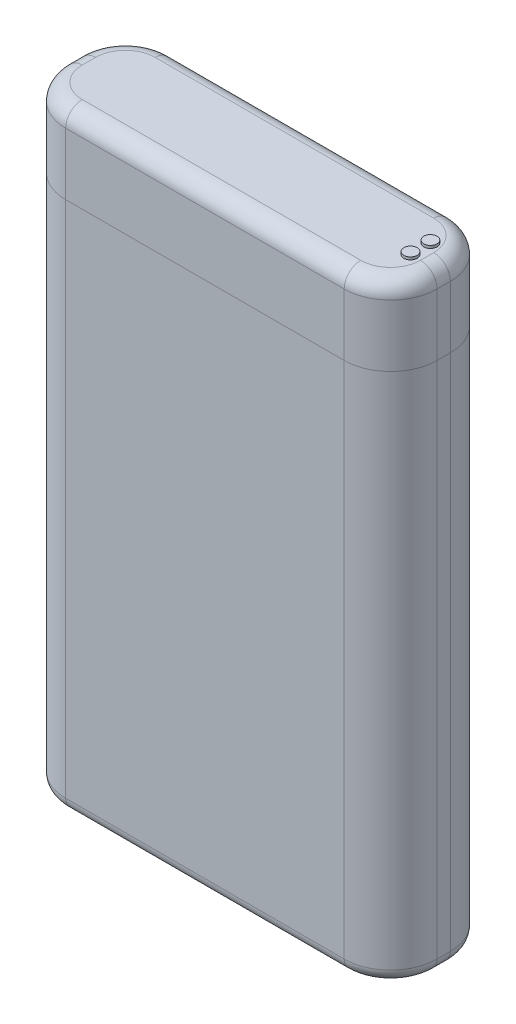
ISO-10303-21;
HEADER;
FILE_DESCRIPTION(('STEP AP214'),'2;1');
FILE_NAME('part.step','',(''),(''),'','','');
FILE_SCHEMA(('AUTOMOTIVE_DESIGN { 1 0 10303 214 1 1 1 1 }'));
ENDSEC;
DATA;
#1=APPLICATION_CONTEXT('core data for automotive mechanical design processes');
#2=APPLICATION_PROTOCOL_DEFINITION('international standard','automotive_design',2000,#1);
#3=PRODUCT_CONTEXT('',#1,'mechanical');
#4=PRODUCT('Part','Part','',(#3));
#5=PRODUCT_RELATED_PRODUCT_CATEGORY('part','',(#4));
#6=PRODUCT_DEFINITION_FORMATION('','',#4);
#7=PRODUCT_DEFINITION_CONTEXT('part definition',#1,'design');
#8=PRODUCT_DEFINITION('design','',#6,#7);
#9=PRODUCT_DEFINITION_SHAPE('','',#8);
#10=(LENGTH_UNIT() NAMED_UNIT(*) SI_UNIT(.MILLI.,.METRE.));
#11=(NAMED_UNIT(*) PLANE_ANGLE_UNIT() SI_UNIT($,.RADIAN.));
#12=(NAMED_UNIT(*) SI_UNIT($,.STERADIAN.) SOLID_ANGLE_UNIT());
#13=UNCERTAINTY_MEASURE_WITH_UNIT(LENGTH_MEASURE(1.E-05),#10,'distance_accuracy_value','');
#14=(GEOMETRIC_REPRESENTATION_CONTEXT(3) GLOBAL_UNCERTAINTY_ASSIGNED_CONTEXT((#13)) GLOBAL_UNIT_ASSIGNED_CONTEXT((#10,
#11,#12)) REPRESENTATION_CONTEXT('',''));
#15=CARTESIAN_POINT('',(0.,0.,0.));
#16=DIRECTION('',(0.,0.,1.));
#17=DIRECTION('',(1.,0.,0.));
#18=AXIS2_PLACEMENT_3D('',#15,#16,#17);
#19=CARTESIAN_POINT('',(-14.,17.0852137104331,0.));
#20=DIRECTION('',(-1.,0.,0.));
#21=DIRECTION('',(0.,0.,1.));
#22=AXIS2_PLACEMENT_3D('',#19,#20,#21);
#23=PLANE('',#22);
#24=DIRECTION('',(0.,0.,-1.));
#25=VECTOR('',#24,1.);
#26=CARTESIAN_POINT('',(-14.,-22.,0.));
#27=LINE('',#26,#25);
#28=CARTESIAN_POINT('',(-14.,-22.,4.5));
#29=VERTEX_POINT('',#28);
#30=CARTESIAN_POINT('',(-14.,-22.,3.5));
#31=VERTEX_POINT('',#30);
#32=EDGE_CURVE('P0_E213',#29,#31,#27,.T.);
#33=ORIENTED_EDGE('',*,*,#32,.F.);
#34=DIRECTION('',(0.,-1.,0.));
#35=VECTOR('',#34,1.);
#36=CARTESIAN_POINT('',(-14.,7.06391028282486,4.5));
#37=LINE('',#36,#35);
#38=CARTESIAN_POINT('',(-14.,17.0852137104331,4.5));
#39=VERTEX_POINT('',#38);
#40=EDGE_CURVE('P0_E11',#39,#29,#37,.T.);
#41=ORIENTED_EDGE('',*,*,#40,.F.);
#42=DIRECTION('',(0.,0.,1.));
#43=VECTOR('',#42,1.);
#44=CARTESIAN_POINT('',(-14.,17.0852137104331,0.));
#45=LINE('',#44,#43);
#46=CARTESIAN_POINT('',(-14.,17.0852137104331,3.5));
#47=VERTEX_POINT('',#46);
#48=EDGE_CURVE('P0_E164',#47,#39,#45,.T.);
#49=ORIENTED_EDGE('',*,*,#48,.F.);
#50=DIRECTION('',(0.,1.,0.));
#51=VECTOR('',#50,1.);
#52=CARTESIAN_POINT('',(-14.,7.06391028282486,3.5));
#53=LINE('',#52,#51);
#54=EDGE_CURVE('P0_E199',#31,#47,#53,.T.);
#55=ORIENTED_EDGE('',*,*,#54,.F.);
#56=EDGE_LOOP('',(#33,#41,#49,#55));
#57=FACE_BOUND('',#56,.T.);
#58=ADVANCED_FACE('P0_F16',(#57),#23,.T.);
#59=CARTESIAN_POINT('',(-10.5,7.06391028282486,4.5));
#60=DIRECTION('',(0.,-1.,0.));
#61=DIRECTION('',(-0.707106781186548,0.,0.707106781186547));
#62=AXIS2_PLACEMENT_3D('',#59,#60,#61);
#63=CYLINDRICAL_SURFACE('',#62,3.5);
#64=CARTESIAN_POINT('',(-10.5,-22.,4.5));
#65=DIRECTION('',(0.,-1.,0.));
#66=DIRECTION('',(-0.707106781186548,0.,0.707106781186547));
#67=AXIS2_PLACEMENT_3D('',#64,#65,#66);
#68=CIRCLE('',#67,3.5);
#69=CARTESIAN_POINT('',(-10.5,-22.,8.));
#70=VERTEX_POINT('',#69);
#71=EDGE_CURVE('P0_E203',#70,#29,#68,.T.);
#72=ORIENTED_EDGE('',*,*,#71,.F.);
#73=DIRECTION('',(0.,1.,0.));
#74=VECTOR('',#73,1.);
#75=CARTESIAN_POINT('',(-10.5,7.06391028282486,8.));
#76=LINE('',#75,#74);
#77=CARTESIAN_POINT('',(-10.5,17.0852137104331,8.));
#78=VERTEX_POINT('',#77);
#79=EDGE_CURVE('P0_E167',#70,#78,#76,.T.);
#80=ORIENTED_EDGE('',*,*,#79,.T.);
#81=CARTESIAN_POINT('',(-10.5,17.0852137104331,4.5));
#82=DIRECTION('',(0.,-1.,0.));
#83=DIRECTION('',(-0.707106781186548,0.,0.707106781186547));
#84=AXIS2_PLACEMENT_3D('',#81,#82,#83);
#85=CIRCLE('',#84,3.5);
#86=EDGE_CURVE('P0_E202',#78,#39,#85,.T.);
#87=ORIENTED_EDGE('',*,*,#86,.T.);
#88=ORIENTED_EDGE('',*,*,#40,.T.);
#89=EDGE_LOOP('',(#72,#80,#87,#88));
#90=FACE_BOUND('',#89,.T.);
#91=ADVANCED_FACE('P0_F332',(#90),#63,.T.);
#92=CARTESIAN_POINT('',(0.,-2.95739314478343,0.));
#93=DIRECTION('',(0.,0.,1.));
#94=DIRECTION('',(1.,0.,0.));
#95=AXIS2_PLACEMENT_3D('',#92,#93,#94);
#96=PLANE('',#95);
#97=DIRECTION('',(1.,0.,0.));
#98=VECTOR('',#97,1.);
#99=CARTESIAN_POINT('',(-7.,-22.,0.));
#100=LINE('',#99,#98);
#101=CARTESIAN_POINT('',(-10.5,-22.,0.));
#102=VERTEX_POINT('',#101);
#103=CARTESIAN_POINT('',(10.5,-22.,0.));
#104=VERTEX_POINT('',#103);
#105=EDGE_CURVE('P0_E140',#102,#104,#100,.T.);
#106=ORIENTED_EDGE('',*,*,#105,.F.);
#107=DIRECTION('',(0.,-1.,0.));
#108=VECTOR('',#107,1.);
#109=CARTESIAN_POINT('',(-10.5,7.06391028282486,0.));
#110=LINE('',#109,#108);
#111=CARTESIAN_POINT('',(-10.5,17.0852137104331,0.));
#112=VERTEX_POINT('',#111);
#113=EDGE_CURVE('P0_E27',#112,#102,#110,.T.);
#114=ORIENTED_EDGE('',*,*,#113,.F.);
#115=DIRECTION('',(1.,0.,0.));
#116=VECTOR('',#115,1.);
#117=CARTESIAN_POINT('',(-14.,17.0852137104331,0.));
#118=LINE('',#117,#116);
#119=CARTESIAN_POINT('',(10.5,17.0852137104331,0.));
#120=VERTEX_POINT('',#119);
#121=EDGE_CURVE('P0_E275',#112,#120,#118,.T.);
#122=ORIENTED_EDGE('',*,*,#121,.T.);
#123=DIRECTION('',(0.,1.,0.));
#124=VECTOR('',#123,1.);
#125=CARTESIAN_POINT('',(10.5,-12.9786965723917,0.));
#126=LINE('',#125,#124);
#127=EDGE_CURVE('P0_E197',#104,#120,#126,.T.);
#128=ORIENTED_EDGE('',*,*,#127,.F.);
#129=EDGE_LOOP('',(#106,#114,#122,#128));
#130=FACE_BOUND('',#129,.T.);
#131=ADVANCED_FACE('P0_F308',(#130),#96,.F.);
#132=CARTESIAN_POINT('',(-10.5,7.06391028282486,3.5));
#133=DIRECTION('',(0.,1.,0.));
#134=DIRECTION('',(-0.707106781186548,0.,-0.707106781186547));
#135=AXIS2_PLACEMENT_3D('',#132,#133,#134);
#136=CYLINDRICAL_SURFACE('',#135,3.5);
#137=CARTESIAN_POINT('',(-10.5,-22.,3.5));
#138=DIRECTION('',(0.,-1.,0.));
#139=DIRECTION('',(-0.707106781186548,0.,-0.707106781186548));
#140=AXIS2_PLACEMENT_3D('',#137,#138,#139);
#141=CIRCLE('',#140,3.5);
#142=EDGE_CURVE('P0_E260',#31,#102,#141,.T.);
#143=ORIENTED_EDGE('',*,*,#142,.F.);
#144=ORIENTED_EDGE('',*,*,#54,.T.);
#145=CARTESIAN_POINT('',(-10.5,17.0852137104331,3.5));
#146=DIRECTION('',(0.,-1.,0.));
#147=DIRECTION('',(-0.707106781186548,0.,-0.707106781186547));
#148=AXIS2_PLACEMENT_3D('',#145,#146,#147);
#149=CIRCLE('',#148,3.5);
#150=EDGE_CURVE('P0_E271',#47,#112,#149,.T.);
#151=ORIENTED_EDGE('',*,*,#150,.T.);
#152=ORIENTED_EDGE('',*,*,#113,.T.);
#153=EDGE_LOOP('',(#143,#144,#151,#152));
#154=FACE_BOUND('',#153,.T.);
#155=ADVANCED_FACE('P0_F346',(#154),#136,.T.);
#156=CARTESIAN_POINT('',(14.,17.0852137104331,0.));
#157=DIRECTION('',(0.,1.,0.));
#158=DIRECTION('',(1.,0.,0.));
#159=AXIS2_PLACEMENT_3D('',#156,#157,#158);
#160=PLANE('',#159);
#161=CARTESIAN_POINT('',(10.5,17.0852137104331,3.5));
#162=DIRECTION('',(0.,-1.,0.));
#163=DIRECTION('',(0.707106781186548,0.,-0.707106781186547));
#164=AXIS2_PLACEMENT_3D('',#161,#162,#163);
#165=CIRCLE('',#164,3.5);
#166=CARTESIAN_POINT('',(14.,17.0852137104331,3.5));
#167=VERTEX_POINT('',#166);
#168=EDGE_CURVE('P0_E20',#120,#167,#165,.T.);
#169=ORIENTED_EDGE('',*,*,#168,.F.);
#170=ORIENTED_EDGE('',*,*,#121,.F.);
#171=ORIENTED_EDGE('',*,*,#150,.F.);
#172=ORIENTED_EDGE('',*,*,#48,.T.);
#173=ORIENTED_EDGE('',*,*,#86,.F.);
#174=DIRECTION('',(-1.,0.,0.));
#175=VECTOR('',#174,1.);
#176=CARTESIAN_POINT('',(-14.,17.0852137104331,8.));
#177=LINE('',#176,#175);
#178=CARTESIAN_POINT('',(10.5,17.0852137104331,8.));
#179=VERTEX_POINT('',#178);
#180=EDGE_CURVE('P0_E165',#179,#78,#177,.T.);
#181=ORIENTED_EDGE('',*,*,#180,.F.);
#182=CARTESIAN_POINT('',(10.5,17.0852137104331,4.5));
#183=DIRECTION('',(0.,-1.,0.));
#184=DIRECTION('',(0.707106781186548,0.,0.707106781186547));
#185=AXIS2_PLACEMENT_3D('',#182,#183,#184);
#186=CIRCLE('',#185,3.5);
#187=CARTESIAN_POINT('',(14.,17.0852137104331,4.5));
#188=VERTEX_POINT('',#187);
#189=EDGE_CURVE('P0_E217',#188,#179,#186,.T.);
#190=ORIENTED_EDGE('',*,*,#189,.F.);
#191=DIRECTION('',(0.,0.,1.));
#192=VECTOR('',#191,1.);
#193=CARTESIAN_POINT('',(14.,17.0852137104331,0.));
#194=LINE('',#193,#192);
#195=EDGE_CURVE('P0_E195',#167,#188,#194,.T.);
#196=ORIENTED_EDGE('',*,*,#195,.F.);
#197=EDGE_LOOP('',(#169,#170,#171,#172,#173,#181,#190,#196));
#198=FACE_BOUND('',#197,.T.);
#199=ADVANCED_FACE('P0_F339',(#198),#160,.T.);
#200=CARTESIAN_POINT('',(-14.,-23.,0.));
#201=DIRECTION('',(0.,-1.,0.));
#202=DIRECTION('',(0.,0.,-1.));
#203=AXIS2_PLACEMENT_3D('',#200,#201,#202);
#204=PLANE('',#203);
#205=CARTESIAN_POINT('',(10.5,-23.,3.5));
#206=DIRECTION('',(0.,1.,0.));
#207=DIRECTION('',(0.707106781186548,0.,-0.707106781186548));
#208=AXIS2_PLACEMENT_3D('',#205,#206,#207);
#209=CIRCLE('',#208,2.5);
#210=CARTESIAN_POINT('',(13.,-23.,3.5));
#211=VERTEX_POINT('',#210);
#212=CARTESIAN_POINT('',(10.5,-23.,1.));
#213=VERTEX_POINT('',#212);
#214=EDGE_CURVE('P0_E130',#211,#213,#209,.T.);
#215=ORIENTED_EDGE('',*,*,#214,.F.);
#216=DIRECTION('',(0.,0.,-1.));
#217=VECTOR('',#216,1.);
#218=CARTESIAN_POINT('',(13.,-23.,0.));
#219=LINE('',#218,#217);
#220=CARTESIAN_POINT('',(13.,-23.,4.5));
#221=VERTEX_POINT('',#220);
#222=EDGE_CURVE('P0_E189',#221,#211,#219,.T.);
#223=ORIENTED_EDGE('',*,*,#222,.F.);
#224=CARTESIAN_POINT('',(10.5,-23.,4.5));
#225=DIRECTION('',(0.,1.,0.));
#226=DIRECTION('',(0.707106781186548,0.,0.707106781186547));
#227=AXIS2_PLACEMENT_3D('',#224,#225,#226);
#228=CIRCLE('',#227,2.5);
#229=CARTESIAN_POINT('',(10.5,-23.,7.));
#230=VERTEX_POINT('',#229);
#231=EDGE_CURVE('P0_E263',#230,#221,#228,.T.);
#232=ORIENTED_EDGE('',*,*,#231,.F.);
#233=DIRECTION('',(1.,0.,0.));
#234=VECTOR('',#233,1.);
#235=CARTESIAN_POINT('',(-7.,-23.,7.));
#236=LINE('',#235,#234);
#237=CARTESIAN_POINT('',(-10.5,-23.,7.));
#238=VERTEX_POINT('',#237);
#239=EDGE_CURVE('P0_E251',#238,#230,#236,.T.);
#240=ORIENTED_EDGE('',*,*,#239,.F.);
#241=CARTESIAN_POINT('',(-10.5,-23.,4.5));
#242=DIRECTION('',(0.,1.,0.));
#243=DIRECTION('',(-0.707106781186548,0.,0.707106781186547));
#244=AXIS2_PLACEMENT_3D('',#241,#242,#243);
#245=CIRCLE('',#244,2.5);
#246=CARTESIAN_POINT('',(-13.,-23.,4.5));
#247=VERTEX_POINT('',#246);
#248=EDGE_CURVE('P0_E207',#247,#238,#245,.T.);
#249=ORIENTED_EDGE('',*,*,#248,.F.);
#250=DIRECTION('',(0.,0.,1.));
#251=VECTOR('',#250,1.);
#252=CARTESIAN_POINT('',(-13.,-23.,0.));
#253=LINE('',#252,#251);
#254=CARTESIAN_POINT('',(-13.,-23.,3.5));
#255=VERTEX_POINT('',#254);
#256=EDGE_CURVE('P0_E209',#255,#247,#253,.T.);
#257=ORIENTED_EDGE('',*,*,#256,.F.);
#258=CARTESIAN_POINT('',(-10.5,-23.,3.5));
#259=DIRECTION('',(0.,1.,0.));
#260=DIRECTION('',(-0.707106781186548,0.,-0.707106781186548));
#261=AXIS2_PLACEMENT_3D('',#258,#259,#260);
#262=CIRCLE('',#261,2.5);
#263=CARTESIAN_POINT('',(-10.5,-23.,1.));
#264=VERTEX_POINT('',#263);
#265=EDGE_CURVE('P0_E134',#264,#255,#262,.T.);
#266=ORIENTED_EDGE('',*,*,#265,.F.);
#267=DIRECTION('',(-1.,0.,0.));
#268=VECTOR('',#267,1.);
#269=CARTESIAN_POINT('',(-7.,-23.,1.));
#270=LINE('',#269,#268);
#271=EDGE_CURVE('P0_E126',#213,#264,#270,.T.);
#272=ORIENTED_EDGE('',*,*,#271,.F.);
#273=EDGE_LOOP('',(#215,#223,#232,#240,#249,#257,#266,#272));
#274=FACE_BOUND('',#273,.T.);
#275=ADVANCED_FACE('P0_F128',(#274),#204,.T.);
#276=CARTESIAN_POINT('',(10.5,-12.9786965723917,3.5));
#277=DIRECTION('',(0.,-1.,0.));
#278=DIRECTION('',(0.707106781186548,0.,-0.707106781186547));
#279=AXIS2_PLACEMENT_3D('',#276,#277,#278);
#280=CYLINDRICAL_SURFACE('',#279,3.5);
#281=CARTESIAN_POINT('',(10.5,-22.,3.5));
#282=DIRECTION('',(0.,-1.,0.));
#283=DIRECTION('',(0.707106781186548,0.,-0.707106781186548));
#284=AXIS2_PLACEMENT_3D('',#281,#282,#283);
#285=CIRCLE('',#284,3.5);
#286=CARTESIAN_POINT('',(14.,-22.,3.5));
#287=VERTEX_POINT('',#286);
#288=EDGE_CURVE('P0_E151',#104,#287,#285,.T.);
#289=ORIENTED_EDGE('',*,*,#288,.F.);
#290=ORIENTED_EDGE('',*,*,#127,.T.);
#291=ORIENTED_EDGE('',*,*,#168,.T.);
#292=DIRECTION('',(0.,-1.,0.));
#293=VECTOR('',#292,1.);
#294=CARTESIAN_POINT('',(14.,-12.9786965723917,3.5));
#295=LINE('',#294,#293);
#296=EDGE_CURVE('P0_E198',#167,#287,#295,.T.);
#297=ORIENTED_EDGE('',*,*,#296,.T.);
#298=EDGE_LOOP('',(#289,#290,#291,#297));
#299=FACE_BOUND('',#298,.T.);
#300=ADVANCED_FACE('P0_F312',(#299),#280,.T.);
#301=CARTESIAN_POINT('',(14.,-23.,0.));
#302=DIRECTION('',(1.,0.,0.));
#303=DIRECTION('',(0.,1.,0.));
#304=AXIS2_PLACEMENT_3D('',#301,#302,#303);
#305=PLANE('',#304);
#306=DIRECTION('',(0.,0.,1.));
#307=VECTOR('',#306,1.);
#308=CARTESIAN_POINT('',(14.,-22.,0.));
#309=LINE('',#308,#307);
#310=CARTESIAN_POINT('',(14.,-22.,4.5));
#311=VERTEX_POINT('',#310);
#312=EDGE_CURVE('P0_E179',#287,#311,#309,.T.);
#313=ORIENTED_EDGE('',*,*,#312,.F.);
#314=ORIENTED_EDGE('',*,*,#296,.F.);
#315=ORIENTED_EDGE('',*,*,#195,.T.);
#316=DIRECTION('',(0.,1.,0.));
#317=VECTOR('',#316,1.);
#318=CARTESIAN_POINT('',(14.,-12.9786965723917,4.5));
#319=LINE('',#318,#317);
#320=EDGE_CURVE('P0_E176',#311,#188,#319,.T.);
#321=ORIENTED_EDGE('',*,*,#320,.F.);
#322=EDGE_LOOP('',(#313,#314,#315,#321));
#323=FACE_BOUND('',#322,.T.);
#324=ADVANCED_FACE('P0_F317',(#323),#305,.T.);
#325=CARTESIAN_POINT('',(10.5,-12.9786965723917,4.5));
#326=DIRECTION('',(0.,1.,0.));
#327=DIRECTION('',(0.707106781186548,0.,0.707106781186547));
#328=AXIS2_PLACEMENT_3D('',#325,#326,#327);
#329=CYLINDRICAL_SURFACE('',#328,3.5);
#330=CARTESIAN_POINT('',(10.5,-22.,4.5));
#331=DIRECTION('',(0.,-1.,0.));
#332=DIRECTION('',(0.707106781186548,0.,0.707106781186547));
#333=AXIS2_PLACEMENT_3D('',#330,#331,#332);
#334=CIRCLE('',#333,3.5);
#335=CARTESIAN_POINT('',(10.5,-22.,8.));
#336=VERTEX_POINT('',#335);
#337=EDGE_CURVE('P0_E250',#311,#336,#334,.T.);
#338=ORIENTED_EDGE('',*,*,#337,.F.);
#339=ORIENTED_EDGE('',*,*,#320,.T.);
#340=ORIENTED_EDGE('',*,*,#189,.T.);
#341=DIRECTION('',(0.,-1.,0.));
#342=VECTOR('',#341,1.);
#343=CARTESIAN_POINT('',(10.5,-12.9786965723917,8.));
#344=LINE('',#343,#342);
#345=EDGE_CURVE('P0_E168',#179,#336,#344,.T.);
#346=ORIENTED_EDGE('',*,*,#345,.T.);
#347=EDGE_LOOP('',(#338,#339,#340,#346));
#348=FACE_BOUND('',#347,.T.);
#349=ADVANCED_FACE('P0_F328',(#348),#329,.T.);
#350=CARTESIAN_POINT('',(0.,-2.95739314478343,8.));
#351=DIRECTION('',(0.,0.,1.));
#352=DIRECTION('',(1.,0.,0.));
#353=AXIS2_PLACEMENT_3D('',#350,#351,#352);
#354=PLANE('',#353);
#355=DIRECTION('',(-1.,0.,0.));
#356=VECTOR('',#355,1.);
#357=CARTESIAN_POINT('',(-7.,-22.,8.));
#358=LINE('',#357,#356);
#359=EDGE_CURVE('P0_E193',#336,#70,#358,.T.);
#360=ORIENTED_EDGE('',*,*,#359,.F.);
#361=ORIENTED_EDGE('',*,*,#345,.F.);
#362=ORIENTED_EDGE('',*,*,#180,.T.);
#363=ORIENTED_EDGE('',*,*,#79,.F.);
#364=EDGE_LOOP('',(#360,#361,#362,#363));
#365=FACE_BOUND('',#364,.T.);
#366=ADVANCED_FACE('P0_F18',(#365),#354,.T.);
#367=CARTESIAN_POINT('',(13.,-22.,0.));
#368=DIRECTION('',(0.,0.,1.));
#369=DIRECTION('',(0.707106781186549,-0.707106781186546,0.));
#370=AXIS2_PLACEMENT_3D('',#367,#368,#369);
#371=CYLINDRICAL_SURFACE('',#370,1.);
#372=CARTESIAN_POINT('',(13.,-22.,4.5));
#373=DIRECTION('',(0.,0.,1.));
#374=DIRECTION('',(0.,-1.,0.));
#375=AXIS2_PLACEMENT_3D('',#372,#373,#374);
#376=CIRCLE('',#375,1.);
#377=EDGE_CURVE('P0_E247',#221,#311,#376,.T.);
#378=ORIENTED_EDGE('',*,*,#377,.F.);
#379=ORIENTED_EDGE('',*,*,#222,.T.);
#380=CARTESIAN_POINT('',(13.,-22.,3.5));
#381=DIRECTION('',(0.,0.,-1.));
#382=DIRECTION('',(1.,0.,0.));
#383=AXIS2_PLACEMENT_3D('',#380,#381,#382);
#384=CIRCLE('',#383,1.);
#385=EDGE_CURVE('P0_E155',#287,#211,#384,.T.);
#386=ORIENTED_EDGE('',*,*,#385,.F.);
#387=ORIENTED_EDGE('',*,*,#312,.T.);
#388=EDGE_LOOP('',(#378,#379,#386,#387));
#389=FACE_BOUND('',#388,.T.);
#390=ADVANCED_FACE('P0_F319',(#389),#371,.T.);
#391=CARTESIAN_POINT('',(10.5,-22.,4.5));
#392=DIRECTION('',(0.,1.,0.));
#393=DIRECTION('',(0.,0.,1.));
#394=AXIS2_PLACEMENT_3D('',#391,#392,#393);
#395=TOROIDAL_SURFACE('',#394,2.5,1.);
#396=ORIENTED_EDGE('',*,*,#377,.T.);
#397=ORIENTED_EDGE('',*,*,#337,.T.);
#398=CARTESIAN_POINT('',(10.5,-22.,7.));
#399=DIRECTION('',(-1.,0.,0.));
#400=DIRECTION('',(0.,-1.,0.));
#401=AXIS2_PLACEMENT_3D('',#398,#399,#400);
#402=CIRCLE('',#401,1.);
#403=EDGE_CURVE('P0_E221',#230,#336,#402,.T.);
#404=ORIENTED_EDGE('',*,*,#403,.F.);
#405=ORIENTED_EDGE('',*,*,#231,.T.);
#406=EDGE_LOOP('',(#396,#397,#404,#405));
#407=FACE_BOUND('',#406,.T.);
#408=ADVANCED_FACE('P0_F289',(#407),#395,.T.);
#409=CARTESIAN_POINT('',(-7.,-22.,7.));
#410=DIRECTION('',(1.,0.,0.));
#411=DIRECTION('',(0.,-0.707106781186547,0.707106781186548));
#412=AXIS2_PLACEMENT_3D('',#409,#410,#411);
#413=CYLINDRICAL_SURFACE('',#412,1.);
#414=ORIENTED_EDGE('',*,*,#403,.T.);
#415=ORIENTED_EDGE('',*,*,#359,.T.);
#416=CARTESIAN_POINT('',(-10.5,-22.,7.));
#417=DIRECTION('',(-1.,0.,0.));
#418=DIRECTION('',(0.,-1.,0.));
#419=AXIS2_PLACEMENT_3D('',#416,#417,#418);
#420=CIRCLE('',#419,1.);
#421=EDGE_CURVE('P0_E208',#238,#70,#420,.T.);
#422=ORIENTED_EDGE('',*,*,#421,.F.);
#423=ORIENTED_EDGE('',*,*,#239,.T.);
#424=EDGE_LOOP('',(#414,#415,#422,#423));
#425=FACE_BOUND('',#424,.T.);
#426=ADVANCED_FACE('P0_F295',(#425),#413,.T.);
#427=CARTESIAN_POINT('',(-10.5,-22.,4.5));
#428=DIRECTION('',(0.,1.,0.));
#429=DIRECTION('',(0.,0.,1.));
#430=AXIS2_PLACEMENT_3D('',#427,#428,#429);
#431=TOROIDAL_SURFACE('',#430,2.5,1.);
#432=ORIENTED_EDGE('',*,*,#421,.T.);
#433=ORIENTED_EDGE('',*,*,#71,.T.);
#434=CARTESIAN_POINT('',(-13.,-22.,4.5));
#435=DIRECTION('',(0.,0.,-1.));
#436=DIRECTION('',(0.,-1.,0.));
#437=AXIS2_PLACEMENT_3D('',#434,#435,#436);
#438=CIRCLE('',#437,1.);
#439=EDGE_CURVE('P0_E233',#247,#29,#438,.T.);
#440=ORIENTED_EDGE('',*,*,#439,.F.);
#441=ORIENTED_EDGE('',*,*,#248,.T.);
#442=EDGE_LOOP('',(#432,#433,#440,#441));
#443=FACE_BOUND('',#442,.T.);
#444=ADVANCED_FACE('P0_F298',(#443),#431,.T.);
#445=CARTESIAN_POINT('',(-13.,-22.,0.));
#446=DIRECTION('',(0.,0.,1.));
#447=DIRECTION('',(-0.707106781186549,-0.707106781186546,0.));
#448=AXIS2_PLACEMENT_3D('',#445,#446,#447);
#449=CYLINDRICAL_SURFACE('',#448,1.);
#450=ORIENTED_EDGE('',*,*,#439,.T.);
#451=ORIENTED_EDGE('',*,*,#32,.T.);
#452=CARTESIAN_POINT('',(-13.,-22.,3.5));
#453=DIRECTION('',(0.,0.,-1.));
#454=DIRECTION('',(0.,-1.,0.));
#455=AXIS2_PLACEMENT_3D('',#452,#453,#454);
#456=CIRCLE('',#455,1.);
#457=EDGE_CURVE('P0_E139',#255,#31,#456,.T.);
#458=ORIENTED_EDGE('',*,*,#457,.F.);
#459=ORIENTED_EDGE('',*,*,#256,.T.);
#460=EDGE_LOOP('',(#450,#451,#458,#459));
#461=FACE_BOUND('',#460,.T.);
#462=ADVANCED_FACE('P0_F301',(#461),#449,.T.);
#463=CARTESIAN_POINT('',(-10.5,-22.,3.5));
#464=DIRECTION('',(0.,1.,0.));
#465=DIRECTION('',(0.,0.,1.));
#466=AXIS2_PLACEMENT_3D('',#463,#464,#465);
#467=TOROIDAL_SURFACE('',#466,2.5,1.);
#468=ORIENTED_EDGE('',*,*,#457,.T.);
#469=ORIENTED_EDGE('',*,*,#142,.T.);
#470=CARTESIAN_POINT('',(-10.5,-22.,1.));
#471=DIRECTION('',(1.,0.,0.));
#472=DIRECTION('',(0.,-1.,0.));
#473=AXIS2_PLACEMENT_3D('',#470,#471,#472);
#474=CIRCLE('',#473,1.);
#475=EDGE_CURVE('P0_E232',#264,#102,#474,.T.);
#476=ORIENTED_EDGE('',*,*,#475,.F.);
#477=ORIENTED_EDGE('',*,*,#265,.T.);
#478=EDGE_LOOP('',(#468,#469,#476,#477));
#479=FACE_BOUND('',#478,.T.);
#480=ADVANCED_FACE('P0_F305',(#479),#467,.T.);
#481=CARTESIAN_POINT('',(-7.,-22.,1.));
#482=DIRECTION('',(-1.,0.,0.));
#483=DIRECTION('',(0.,-0.707106781186546,-0.707106781186549));
#484=AXIS2_PLACEMENT_3D('',#481,#482,#483);
#485=CYLINDRICAL_SURFACE('',#484,1.);
#486=ORIENTED_EDGE('',*,*,#475,.T.);
#487=ORIENTED_EDGE('',*,*,#105,.T.);
#488=CARTESIAN_POINT('',(10.5,-22.,1.));
#489=DIRECTION('',(1.,0.,0.));
#490=DIRECTION('',(0.,-1.,0.));
#491=AXIS2_PLACEMENT_3D('',#488,#489,#490);
#492=CIRCLE('',#491,1.);
#493=EDGE_CURVE('P0_E144',#213,#104,#492,.T.);
#494=ORIENTED_EDGE('',*,*,#493,.F.);
#495=ORIENTED_EDGE('',*,*,#271,.T.);
#496=EDGE_LOOP('',(#486,#487,#494,#495));
#497=FACE_BOUND('',#496,.T.);
#498=ADVANCED_FACE('P0_F145',(#497),#485,.T.);
#499=CARTESIAN_POINT('',(10.5,-22.,3.5));
#500=DIRECTION('',(0.,1.,0.));
#501=DIRECTION('',(0.,0.,1.));
#502=AXIS2_PLACEMENT_3D('',#499,#500,#501);
#503=TOROIDAL_SURFACE('',#502,2.5,1.);
#504=ORIENTED_EDGE('',*,*,#385,.T.);
#505=ORIENTED_EDGE('',*,*,#214,.T.);
#506=ORIENTED_EDGE('',*,*,#493,.T.);
#507=ORIENTED_EDGE('',*,*,#288,.T.);
#508=EDGE_LOOP('',(#504,#505,#506,#507));
#509=FACE_BOUND('',#508,.T.);
#510=ADVANCED_FACE('P0_F153',(#509),#503,.T.);
#511=CLOSED_SHELL('',(#58,#91,#131,#155,#199,#275,#300,#324,#349,#366,#390,#408,#426,#444,#462,
#480,#498,#510));
#512=MANIFOLD_SOLID_BREP('P0_B1',#511);
#513=CARTESIAN_POINT('',(14.,17.0852137104331,0.));
#514=DIRECTION('',(1.,0.,0.));
#515=DIRECTION('',(0.,1.,0.));
#516=AXIS2_PLACEMENT_3D('',#513,#514,#515);
#517=PLANE('',#516);
#518=DIRECTION('',(0.,0.,-1.));
#519=VECTOR('',#518,1.);
#520=CARTESIAN_POINT('',(14.,21.75,0.));
#521=LINE('',#520,#519);
#522=CARTESIAN_POINT('',(14.,21.75,4.5));
#523=VERTEX_POINT('',#522);
#524=CARTESIAN_POINT('',(14.,21.75,3.5));
#525=VERTEX_POINT('',#524);
#526=EDGE_CURVE('P1_E177',#523,#525,#521,.T.);
#527=ORIENTED_EDGE('',*,*,#526,.F.);
#528=DIRECTION('',(0.,1.,0.));
#529=VECTOR('',#528,1.);
#530=CARTESIAN_POINT('',(14.,18.5639102828249,4.5));
#531=LINE('',#530,#529);
#532=CARTESIAN_POINT('',(14.,17.0852137104331,4.5));
#533=VERTEX_POINT('',#532);
#534=EDGE_CURVE('P1_E27',#533,#523,#531,.T.);
#535=ORIENTED_EDGE('',*,*,#534,.F.);
#536=DIRECTION('',(0.,0.,1.));
#537=VECTOR('',#536,1.);
#538=CARTESIAN_POINT('',(14.,17.0852137104331,0.));
#539=LINE('',#538,#537);
#540=CARTESIAN_POINT('',(14.,17.0852137104331,3.5));
#541=VERTEX_POINT('',#540);
#542=EDGE_CURVE('P1_E213',#541,#533,#539,.T.);
#543=ORIENTED_EDGE('',*,*,#542,.F.);
#544=DIRECTION('',(0.,-1.,0.));
#545=VECTOR('',#544,1.);
#546=CARTESIAN_POINT('',(14.,18.5639102828249,3.5));
#547=LINE('',#546,#545);
#548=EDGE_CURVE('P1_E214',#525,#541,#547,.T.);
#549=ORIENTED_EDGE('',*,*,#548,.F.);
#550=EDGE_LOOP('',(#527,#535,#543,#549));
#551=FACE_BOUND('',#550,.T.);
#552=ADVANCED_FACE('P1_F16',(#551),#517,.T.);
#553=CARTESIAN_POINT('',(-10.5,21.5213034276083,4.5));
#554=DIRECTION('',(0.,-1.,0.));
#555=DIRECTION('',(-0.707106781186548,0.,0.707106781186547));
#556=AXIS2_PLACEMENT_3D('',#553,#554,#555);
#557=CYLINDRICAL_SURFACE('',#556,3.5);
#558=CARTESIAN_POINT('',(-10.5,21.75,4.5));
#559=DIRECTION('',(0.,1.,0.));
#560=DIRECTION('',(-0.707106781186548,0.,0.707106781186547));
#561=AXIS2_PLACEMENT_3D('',#558,#559,#560);
#562=CIRCLE('',#561,3.5);
#563=CARTESIAN_POINT('',(-14.,21.75,4.5));
#564=VERTEX_POINT('',#563);
#565=CARTESIAN_POINT('',(-10.5,21.75,8.));
#566=VERTEX_POINT('',#565);
#567=EDGE_CURVE('P1_E158',#564,#566,#562,.T.);
#568=ORIENTED_EDGE('',*,*,#567,.F.);
#569=DIRECTION('',(0.,-1.,0.));
#570=VECTOR('',#569,1.);
#571=CARTESIAN_POINT('',(-14.,21.5213034276083,4.5));
#572=LINE('',#571,#570);
#573=CARTESIAN_POINT('',(-14.,17.0852137104331,4.5));
#574=VERTEX_POINT('',#573);
#575=EDGE_CURVE('P1_E155',#564,#574,#572,.T.);
#576=ORIENTED_EDGE('',*,*,#575,.T.);
#577=CARTESIAN_POINT('',(-10.5,17.0852137104331,4.5));
#578=DIRECTION('',(0.,1.,0.));
#579=DIRECTION('',(-0.707106781186548,0.,0.707106781186547));
#580=AXIS2_PLACEMENT_3D('',#577,#578,#579);
#581=CIRCLE('',#580,3.5);
#582=CARTESIAN_POINT('',(-10.5,17.0852137104331,8.));
#583=VERTEX_POINT('',#582);
#584=EDGE_CURVE('P1_E142',#574,#583,#581,.T.);
#585=ORIENTED_EDGE('',*,*,#584,.T.);
#586=DIRECTION('',(0.,1.,0.));
#587=VECTOR('',#586,1.);
#588=CARTESIAN_POINT('',(-10.5,21.5213034276083,8.));
#589=LINE('',#588,#587);
#590=EDGE_CURVE('P1_E11',#583,#566,#589,.T.);
#591=ORIENTED_EDGE('',*,*,#590,.T.);
#592=EDGE_LOOP('',(#568,#576,#585,#591));
#593=FACE_BOUND('',#592,.T.);
#594=ADVANCED_FACE('P1_F156',(#593),#557,.T.);
#595=CARTESIAN_POINT('',(0.,20.0426068552166,8.));
#596=DIRECTION('',(0.,0.,1.));
#597=DIRECTION('',(1.,0.,0.));
#598=AXIS2_PLACEMENT_3D('',#595,#596,#597);
#599=PLANE('',#598);
#600=DIRECTION('',(1.,0.,0.));
#601=VECTOR('',#600,1.);
#602=CARTESIAN_POINT('',(7.,21.75,8.));
#603=LINE('',#602,#601);
#604=CARTESIAN_POINT('',(10.5,21.75,8.));
#605=VERTEX_POINT('',#604);
#606=EDGE_CURVE('P1_E231',#566,#605,#603,.T.);
#607=ORIENTED_EDGE('',*,*,#606,.F.);
#608=ORIENTED_EDGE('',*,*,#590,.F.);
#609=DIRECTION('',(1.,0.,0.));
#610=VECTOR('',#609,1.);
#611=CARTESIAN_POINT('',(-14.,17.0852137104331,8.));
#612=LINE('',#611,#610);
#613=CARTESIAN_POINT('',(10.5,17.0852137104331,8.));
#614=VERTEX_POINT('',#613);
#615=EDGE_CURVE('P1_E150',#583,#614,#612,.T.);
#616=ORIENTED_EDGE('',*,*,#615,.T.);
#617=DIRECTION('',(0.,-1.,0.));
#618=VECTOR('',#617,1.);
#619=CARTESIAN_POINT('',(10.5,18.5639102828249,8.));
#620=LINE('',#619,#618);
#621=EDGE_CURVE('P1_E54',#605,#614,#620,.T.);
#622=ORIENTED_EDGE('',*,*,#621,.F.);
#623=EDGE_LOOP('',(#607,#608,#616,#622));
#624=FACE_BOUND('',#623,.T.);
#625=ADVANCED_FACE('P1_F355',(#624),#599,.T.);
#626=CARTESIAN_POINT('',(10.5,18.5639102828249,4.5));
#627=DIRECTION('',(0.,1.,0.));
#628=DIRECTION('',(0.707106781186548,0.,0.707106781186547));
#629=AXIS2_PLACEMENT_3D('',#626,#627,#628);
#630=CYLINDRICAL_SURFACE('',#629,3.5);
#631=CARTESIAN_POINT('',(10.5,21.75,4.5));
#632=DIRECTION('',(0.,1.,0.));
#633=DIRECTION('',(0.707106781186548,0.,0.707106781186547));
#634=AXIS2_PLACEMENT_3D('',#631,#632,#633);
#635=CIRCLE('',#634,3.5);
#636=EDGE_CURVE('P1_E191',#605,#523,#635,.T.);
#637=ORIENTED_EDGE('',*,*,#636,.F.);
#638=ORIENTED_EDGE('',*,*,#621,.T.);
#639=CARTESIAN_POINT('',(10.5,17.0852137104331,4.5));
#640=DIRECTION('',(0.,1.,0.));
#641=DIRECTION('',(0.707106781186548,0.,0.707106781186547));
#642=AXIS2_PLACEMENT_3D('',#639,#640,#641);
#643=CIRCLE('',#642,3.5);
#644=EDGE_CURVE('P1_E235',#614,#533,#643,.T.);
#645=ORIENTED_EDGE('',*,*,#644,.T.);
#646=ORIENTED_EDGE('',*,*,#534,.T.);
#647=EDGE_LOOP('',(#637,#638,#645,#646));
#648=FACE_BOUND('',#647,.T.);
#649=ADVANCED_FACE('P1_F353',(#648),#630,.T.);
#650=CARTESIAN_POINT('',(-14.,17.0852137104331,0.));
#651=DIRECTION('',(0.,-1.,0.));
#652=DIRECTION('',(0.,0.,-1.));
#653=AXIS2_PLACEMENT_3D('',#650,#651,#652);
#654=PLANE('',#653);
#655=CARTESIAN_POINT('',(10.5,17.0852137104331,3.5));
#656=DIRECTION('',(0.,1.,0.));
#657=DIRECTION('',(0.707106781186548,0.,-0.707106781186547));
#658=AXIS2_PLACEMENT_3D('',#655,#656,#657);
#659=CIRCLE('',#658,3.5);
#660=CARTESIAN_POINT('',(10.5,17.0852137104331,0.));
#661=VERTEX_POINT('',#660);
#662=EDGE_CURVE('P1_E209',#541,#661,#659,.T.);
#663=ORIENTED_EDGE('',*,*,#662,.F.);
#664=ORIENTED_EDGE('',*,*,#542,.T.);
#665=ORIENTED_EDGE('',*,*,#644,.F.);
#666=ORIENTED_EDGE('',*,*,#615,.F.);
#667=ORIENTED_EDGE('',*,*,#584,.F.);
#668=DIRECTION('',(0.,0.,1.));
#669=VECTOR('',#668,1.);
#670=CARTESIAN_POINT('',(-14.,17.0852137104331,0.));
#671=LINE('',#670,#669);
#672=CARTESIAN_POINT('',(-14.,17.0852137104331,3.5));
#673=VERTEX_POINT('',#672);
#674=EDGE_CURVE('P1_E147',#673,#574,#671,.T.);
#675=ORIENTED_EDGE('',*,*,#674,.F.);
#676=CARTESIAN_POINT('',(-10.5,17.0852137104331,3.5));
#677=DIRECTION('',(0.,1.,0.));
#678=DIRECTION('',(-0.707106781186548,0.,-0.707106781186547));
#679=AXIS2_PLACEMENT_3D('',#676,#677,#678);
#680=CIRCLE('',#679,3.5);
#681=CARTESIAN_POINT('',(-10.5,17.0852137104331,0.));
#682=VERTEX_POINT('',#681);
#683=EDGE_CURVE('P1_E136',#682,#673,#680,.T.);
#684=ORIENTED_EDGE('',*,*,#683,.F.);
#685=DIRECTION('',(1.,0.,0.));
#686=VECTOR('',#685,1.);
#687=CARTESIAN_POINT('',(-14.,17.0852137104331,0.));
#688=LINE('',#687,#686);
#689=EDGE_CURVE('P1_E242',#682,#661,#688,.T.);
#690=ORIENTED_EDGE('',*,*,#689,.T.);
#691=EDGE_LOOP('',(#663,#664,#665,#666,#667,#675,#684,#690));
#692=FACE_BOUND('',#691,.T.);
#693=ADVANCED_FACE('P1_F145',(#692),#654,.T.);
#694=CARTESIAN_POINT('',(14.,23.,0.));
#695=DIRECTION('',(0.,1.,0.));
#696=DIRECTION('',(1.,0.,0.));
#697=AXIS2_PLACEMENT_3D('',#694,#695,#696);
#698=PLANE('',#697);
#699=CARTESIAN_POINT('',(10.5,23.,3.5));
#700=DIRECTION('',(0.,-1.,0.));
#701=DIRECTION('',(0.707106781186548,0.,-0.707106781186548));
#702=AXIS2_PLACEMENT_3D('',#699,#700,#701);
#703=CIRCLE('',#702,2.25);
#704=CARTESIAN_POINT('',(10.5,23.,1.25));
#705=VERTEX_POINT('',#704);
#706=CARTESIAN_POINT('',(12.75,23.,3.5));
#707=VERTEX_POINT('',#706);
#708=EDGE_CURVE('P1_E203',#705,#707,#703,.T.);
#709=ORIENTED_EDGE('',*,*,#708,.F.);
#710=DIRECTION('',(1.,0.,0.));
#711=VECTOR('',#710,1.);
#712=CARTESIAN_POINT('',(7.,23.,1.25));
#713=LINE('',#712,#711);
#714=CARTESIAN_POINT('',(-10.5,23.,1.25));
#715=VERTEX_POINT('',#714);
#716=EDGE_CURVE('P1_E174',#715,#705,#713,.T.);
#717=ORIENTED_EDGE('',*,*,#716,.F.);
#718=CARTESIAN_POINT('',(-10.5,23.,3.5));
#719=DIRECTION('',(0.,-1.,0.));
#720=DIRECTION('',(-0.707106781186548,0.,-0.707106781186548));
#721=AXIS2_PLACEMENT_3D('',#718,#719,#720);
#722=CIRCLE('',#721,2.25);
#723=CARTESIAN_POINT('',(-12.75,23.,3.5));
#724=VERTEX_POINT('',#723);
#725=EDGE_CURVE('P1_E182',#724,#715,#722,.T.);
#726=ORIENTED_EDGE('',*,*,#725,.F.);
#727=DIRECTION('',(0.,0.,-1.));
#728=VECTOR('',#727,1.);
#729=CARTESIAN_POINT('',(-12.75,23.,0.));
#730=LINE('',#729,#728);
#731=CARTESIAN_POINT('',(-12.75,23.,4.5));
#732=VERTEX_POINT('',#731);
#733=EDGE_CURVE('P1_E193',#732,#724,#730,.T.);
#734=ORIENTED_EDGE('',*,*,#733,.F.);
#735=CARTESIAN_POINT('',(-10.5,23.,4.5));
#736=DIRECTION('',(0.,-1.,0.));
#737=DIRECTION('',(-0.707106781186548,0.,0.707106781186547));
#738=AXIS2_PLACEMENT_3D('',#735,#736,#737);
#739=CIRCLE('',#738,2.25);
#740=CARTESIAN_POINT('',(-10.5,23.,6.75));
#741=VERTEX_POINT('',#740);
#742=EDGE_CURVE('P1_E198',#741,#732,#739,.T.);
#743=ORIENTED_EDGE('',*,*,#742,.F.);
#744=DIRECTION('',(-1.,0.,0.));
#745=VECTOR('',#744,1.);
#746=CARTESIAN_POINT('',(7.,23.,6.75));
#747=LINE('',#746,#745);
#748=CARTESIAN_POINT('',(10.5,23.,6.75));
#749=VERTEX_POINT('',#748);
#750=EDGE_CURVE('P1_E20',#749,#741,#747,.T.);
#751=ORIENTED_EDGE('',*,*,#750,.F.);
#752=CARTESIAN_POINT('',(10.5,23.,4.5));
#753=DIRECTION('',(0.,-1.,0.));
#754=DIRECTION('',(0.707106781186548,0.,0.707106781186547));
#755=AXIS2_PLACEMENT_3D('',#752,#753,#754);
#756=CIRCLE('',#755,2.25);
#757=CARTESIAN_POINT('',(12.75,23.,4.5));
#758=VERTEX_POINT('',#757);
#759=EDGE_CURVE('P1_E226',#758,#749,#756,.T.);
#760=ORIENTED_EDGE('',*,*,#759,.F.);
#761=DIRECTION('',(0.,0.,1.));
#762=VECTOR('',#761,1.);
#763=CARTESIAN_POINT('',(12.75,23.,0.));
#764=LINE('',#763,#762);
#765=EDGE_CURVE('P1_E192',#707,#758,#764,.T.);
#766=ORIENTED_EDGE('',*,*,#765,.F.);
#767=EDGE_LOOP('',(#709,#717,#726,#734,#743,#751,#760,#766));
#768=FACE_BOUND('',#767,.T.);
#769=ADVANCED_FACE('P1_F385',(#768),#698,.T.);
#770=CARTESIAN_POINT('',(10.5,18.5639102828249,3.5));
#771=DIRECTION('',(0.,-1.,0.));
#772=DIRECTION('',(0.707106781186548,0.,-0.707106781186547));
#773=AXIS2_PLACEMENT_3D('',#770,#771,#772);
#774=CYLINDRICAL_SURFACE('',#773,3.5);
#775=CARTESIAN_POINT('',(10.5,21.75,3.5));
#776=DIRECTION('',(0.,1.,0.));
#777=DIRECTION('',(0.707106781186548,0.,-0.707106781186548));
#778=AXIS2_PLACEMENT_3D('',#775,#776,#777);
#779=CIRCLE('',#778,3.5);
#780=CARTESIAN_POINT('',(10.5,21.75,0.));
#781=VERTEX_POINT('',#780);
#782=EDGE_CURVE('P1_E246',#525,#781,#779,.T.);
#783=ORIENTED_EDGE('',*,*,#782,.F.);
#784=ORIENTED_EDGE('',*,*,#548,.T.);
#785=ORIENTED_EDGE('',*,*,#662,.T.);
#786=DIRECTION('',(0.,1.,0.));
#787=VECTOR('',#786,1.);
#788=CARTESIAN_POINT('',(10.5,18.5639102828249,0.));
#789=LINE('',#788,#787);
#790=EDGE_CURVE('P1_E186',#661,#781,#789,.T.);
#791=ORIENTED_EDGE('',*,*,#790,.T.);
#792=EDGE_LOOP('',(#783,#784,#785,#791));
#793=FACE_BOUND('',#792,.T.);
#794=ADVANCED_FACE('P1_F298',(#793),#774,.T.);
#795=CARTESIAN_POINT('',(0.,20.0426068552166,0.));
#796=DIRECTION('',(0.,0.,1.));
#797=DIRECTION('',(1.,0.,0.));
#798=AXIS2_PLACEMENT_3D('',#795,#796,#797);
#799=PLANE('',#798);
#800=DIRECTION('',(-1.,0.,0.));
#801=VECTOR('',#800,1.);
#802=CARTESIAN_POINT('',(7.,21.75,0.));
#803=LINE('',#802,#801);
#804=CARTESIAN_POINT('',(-10.5,21.75,0.));
#805=VERTEX_POINT('',#804);
#806=EDGE_CURVE('P1_E256',#781,#805,#803,.T.);
#807=ORIENTED_EDGE('',*,*,#806,.F.);
#808=ORIENTED_EDGE('',*,*,#790,.F.);
#809=ORIENTED_EDGE('',*,*,#689,.F.);
#810=DIRECTION('',(0.,-1.,0.));
#811=VECTOR('',#810,1.);
#812=CARTESIAN_POINT('',(-10.5,21.5213034276083,0.));
#813=LINE('',#812,#811);
#814=EDGE_CURVE('P1_E164',#805,#682,#813,.T.);
#815=ORIENTED_EDGE('',*,*,#814,.F.);
#816=EDGE_LOOP('',(#807,#808,#809,#815));
#817=FACE_BOUND('',#816,.T.);
#818=ADVANCED_FACE('P1_F18',(#817),#799,.F.);
#819=CARTESIAN_POINT('',(-10.5,21.5213034276083,3.5));
#820=DIRECTION('',(0.,1.,0.));
#821=DIRECTION('',(-0.707106781186548,0.,-0.707106781186547));
#822=AXIS2_PLACEMENT_3D('',#819,#820,#821);
#823=CYLINDRICAL_SURFACE('',#822,3.5);
#824=CARTESIAN_POINT('',(-10.5,21.75,3.5));
#825=DIRECTION('',(0.,1.,0.));
#826=DIRECTION('',(-0.707106781186548,0.,-0.707106781186548));
#827=AXIS2_PLACEMENT_3D('',#824,#825,#826);
#828=CIRCLE('',#827,3.5);
#829=CARTESIAN_POINT('',(-14.,21.75,3.5));
#830=VERTEX_POINT('',#829);
#831=EDGE_CURVE('P1_E179',#805,#830,#828,.T.);
#832=ORIENTED_EDGE('',*,*,#831,.F.);
#833=ORIENTED_EDGE('',*,*,#814,.T.);
#834=ORIENTED_EDGE('',*,*,#683,.T.);
#835=DIRECTION('',(0.,1.,0.));
#836=VECTOR('',#835,1.);
#837=CARTESIAN_POINT('',(-14.,21.5213034276083,3.5));
#838=LINE('',#837,#836);
#839=EDGE_CURVE('P1_E167',#673,#830,#838,.T.);
#840=ORIENTED_EDGE('',*,*,#839,.T.);
#841=EDGE_LOOP('',(#832,#833,#834,#840));
#842=FACE_BOUND('',#841,.T.);
#843=ADVANCED_FACE('P1_F283',(#842),#823,.T.);
#844=CARTESIAN_POINT('',(-14.,23.,0.));
#845=DIRECTION('',(-1.,0.,0.));
#846=DIRECTION('',(0.,0.,1.));
#847=AXIS2_PLACEMENT_3D('',#844,#845,#846);
#848=PLANE('',#847);
#849=DIRECTION('',(0.,0.,1.));
#850=VECTOR('',#849,1.);
#851=CARTESIAN_POINT('',(-14.,21.75,0.));
#852=LINE('',#851,#850);
#853=EDGE_CURVE('P1_E197',#830,#564,#852,.T.);
#854=ORIENTED_EDGE('',*,*,#853,.F.);
#855=ORIENTED_EDGE('',*,*,#839,.F.);
#856=ORIENTED_EDGE('',*,*,#674,.T.);
#857=ORIENTED_EDGE('',*,*,#575,.F.);
#858=EDGE_LOOP('',(#854,#855,#856,#857));
#859=FACE_BOUND('',#858,.T.);
#860=ADVANCED_FACE('P1_F166',(#859),#848,.T.);
#861=CARTESIAN_POINT('',(7.,21.75,1.25));
#862=DIRECTION('',(1.,0.,0.));
#863=DIRECTION('',(0.,0.707106781186548,-0.707106781186548));
#864=AXIS2_PLACEMENT_3D('',#861,#862,#863);
#865=CYLINDRICAL_SURFACE('',#864,1.25);
#866=CARTESIAN_POINT('',(10.5,21.75,1.25));
#867=DIRECTION('',(1.,0.,0.));
#868=DIRECTION('',(0.,0.,-1.));
#869=AXIS2_PLACEMENT_3D('',#866,#867,#868);
#870=CIRCLE('',#869,1.25);
#871=EDGE_CURVE('P1_E208',#781,#705,#870,.T.);
#872=ORIENTED_EDGE('',*,*,#871,.F.);
#873=ORIENTED_EDGE('',*,*,#806,.T.);
#874=CARTESIAN_POINT('',(-10.5,21.75,1.25));
#875=DIRECTION('',(-1.,0.,0.));
#876=DIRECTION('',(0.,1.,0.));
#877=AXIS2_PLACEMENT_3D('',#874,#875,#876);
#878=CIRCLE('',#877,1.25);
#879=EDGE_CURVE('P1_E183',#715,#805,#878,.T.);
#880=ORIENTED_EDGE('',*,*,#879,.F.);
#881=ORIENTED_EDGE('',*,*,#716,.T.);
#882=EDGE_LOOP('',(#872,#873,#880,#881));
#883=FACE_BOUND('',#882,.T.);
#884=ADVANCED_FACE('P1_F290',(#883),#865,.T.);
#885=CARTESIAN_POINT('',(-10.5,21.75,3.5));
#886=DIRECTION('',(0.,-1.,0.));
#887=DIRECTION('',(0.,0.,-1.));
#888=AXIS2_PLACEMENT_3D('',#885,#886,#887);
#889=TOROIDAL_SURFACE('',#888,2.25,1.25);
#890=ORIENTED_EDGE('',*,*,#879,.T.);
#891=ORIENTED_EDGE('',*,*,#831,.T.);
#892=CARTESIAN_POINT('',(-12.75,21.75,3.5));
#893=DIRECTION('',(0.,0.,1.));
#894=DIRECTION('',(0.,1.,0.));
#895=AXIS2_PLACEMENT_3D('',#892,#893,#894);
#896=CIRCLE('',#895,1.25);
#897=EDGE_CURVE('P1_E202',#724,#830,#896,.T.);
#898=ORIENTED_EDGE('',*,*,#897,.F.);
#899=ORIENTED_EDGE('',*,*,#725,.T.);
#900=EDGE_LOOP('',(#890,#891,#898,#899));
#901=FACE_BOUND('',#900,.T.);
#902=ADVANCED_FACE('P1_F384',(#901),#889,.T.);
#903=CARTESIAN_POINT('',(-12.75,21.75,0.));
#904=DIRECTION('',(0.,0.,1.));
#905=DIRECTION('',(-0.707106781186548,0.707106781186548,0.));
#906=AXIS2_PLACEMENT_3D('',#903,#904,#905);
#907=CYLINDRICAL_SURFACE('',#906,1.25);
#908=ORIENTED_EDGE('',*,*,#897,.T.);
#909=ORIENTED_EDGE('',*,*,#853,.T.);
#910=CARTESIAN_POINT('',(-12.75,21.75,4.5));
#911=DIRECTION('',(0.,0.,1.));
#912=DIRECTION('',(0.,1.,0.));
#913=AXIS2_PLACEMENT_3D('',#910,#911,#912);
#914=CIRCLE('',#913,1.25);
#915=EDGE_CURVE('P1_E238',#732,#564,#914,.T.);
#916=ORIENTED_EDGE('',*,*,#915,.F.);
#917=ORIENTED_EDGE('',*,*,#733,.T.);
#918=EDGE_LOOP('',(#908,#909,#916,#917));
#919=FACE_BOUND('',#918,.T.);
#920=ADVANCED_FACE('P1_F381',(#919),#907,.T.);
#921=CARTESIAN_POINT('',(-10.5,21.75,4.5));
#922=DIRECTION('',(0.,-1.,0.));
#923=DIRECTION('',(0.,0.,-1.));
#924=AXIS2_PLACEMENT_3D('',#921,#922,#923);
#925=TOROIDAL_SURFACE('',#924,2.25,1.25);
#926=ORIENTED_EDGE('',*,*,#915,.T.);
#927=ORIENTED_EDGE('',*,*,#567,.T.);
#928=CARTESIAN_POINT('',(-10.5,21.75,6.75));
#929=DIRECTION('',(1.,0.,0.));
#930=DIRECTION('',(0.,1.,0.));
#931=AXIS2_PLACEMENT_3D('',#928,#929,#930);
#932=CIRCLE('',#931,1.25);
#933=EDGE_CURVE('P1_E227',#741,#566,#932,.T.);
#934=ORIENTED_EDGE('',*,*,#933,.F.);
#935=ORIENTED_EDGE('',*,*,#742,.T.);
#936=EDGE_LOOP('',(#926,#927,#934,#935));
#937=FACE_BOUND('',#936,.T.);
#938=ADVANCED_FACE('P1_F378',(#937),#925,.T.);
#939=CARTESIAN_POINT('',(7.,21.75,6.75));
#940=DIRECTION('',(-1.,0.,0.));
#941=DIRECTION('',(0.,0.707106781186548,0.707106781186548));
#942=AXIS2_PLACEMENT_3D('',#939,#940,#941);
#943=CYLINDRICAL_SURFACE('',#942,1.25);
#944=ORIENTED_EDGE('',*,*,#933,.T.);
#945=ORIENTED_EDGE('',*,*,#606,.T.);
#946=CARTESIAN_POINT('',(10.5,21.75,6.75));
#947=DIRECTION('',(1.,0.,0.));
#948=DIRECTION('',(0.,1.,0.));
#949=AXIS2_PLACEMENT_3D('',#946,#947,#948);
#950=CIRCLE('',#949,1.25);
#951=EDGE_CURVE('P1_E187',#749,#605,#950,.T.);
#952=ORIENTED_EDGE('',*,*,#951,.F.);
#953=ORIENTED_EDGE('',*,*,#750,.T.);
#954=EDGE_LOOP('',(#944,#945,#952,#953));
#955=FACE_BOUND('',#954,.T.);
#956=ADVANCED_FACE('P1_F375',(#955),#943,.T.);
#957=CARTESIAN_POINT('',(10.5,21.75,4.5));
#958=DIRECTION('',(0.,-1.,0.));
#959=DIRECTION('',(0.,0.,-1.));
#960=AXIS2_PLACEMENT_3D('',#957,#958,#959);
#961=TOROIDAL_SURFACE('',#960,2.25,1.25);
#962=ORIENTED_EDGE('',*,*,#951,.T.);
#963=ORIENTED_EDGE('',*,*,#636,.T.);
#964=CARTESIAN_POINT('',(12.75,21.75,4.5));
#965=DIRECTION('',(0.,0.,-1.));
#966=DIRECTION('',(0.,1.,0.));
#967=AXIS2_PLACEMENT_3D('',#964,#965,#966);
#968=CIRCLE('',#967,1.25);
#969=EDGE_CURVE('P1_E250',#758,#523,#968,.T.);
#970=ORIENTED_EDGE('',*,*,#969,.F.);
#971=ORIENTED_EDGE('',*,*,#759,.T.);
#972=EDGE_LOOP('',(#962,#963,#970,#971));
#973=FACE_BOUND('',#972,.T.);
#974=ADVANCED_FACE('P1_F372',(#973),#961,.T.);
#975=CARTESIAN_POINT('',(12.75,21.75,0.));
#976=DIRECTION('',(0.,0.,1.));
#977=DIRECTION('',(0.707106781186548,0.707106781186548,0.));
#978=AXIS2_PLACEMENT_3D('',#975,#976,#977);
#979=CYLINDRICAL_SURFACE('',#978,1.25);
#980=ORIENTED_EDGE('',*,*,#969,.T.);
#981=ORIENTED_EDGE('',*,*,#526,.T.);
#982=CARTESIAN_POINT('',(12.75,21.75,3.5));
#983=DIRECTION('',(0.,0.,-1.));
#984=DIRECTION('',(0.,1.,0.));
#985=AXIS2_PLACEMENT_3D('',#982,#983,#984);
#986=CIRCLE('',#985,1.25);
#987=EDGE_CURVE('P1_E207',#707,#525,#986,.T.);
#988=ORIENTED_EDGE('',*,*,#987,.F.);
#989=ORIENTED_EDGE('',*,*,#765,.T.);
#990=EDGE_LOOP('',(#980,#981,#988,#989));
#991=FACE_BOUND('',#990,.T.);
#992=ADVANCED_FACE('P1_F369',(#991),#979,.T.);
#993=CARTESIAN_POINT('',(10.5,21.75,3.5));
#994=DIRECTION('',(0.,-1.,0.));
#995=DIRECTION('',(0.,0.,-1.));
#996=AXIS2_PLACEMENT_3D('',#993,#994,#995);
#997=TOROIDAL_SURFACE('',#996,2.25,1.25);
#998=ORIENTED_EDGE('',*,*,#871,.T.);
#999=ORIENTED_EDGE('',*,*,#708,.T.);
#1000=ORIENTED_EDGE('',*,*,#987,.T.);
#1001=ORIENTED_EDGE('',*,*,#782,.T.);
#1002=EDGE_LOOP('',(#998,#999,#1000,#1001));
#1003=FACE_BOUND('',#1002,.T.);
#1004=ADVANCED_FACE('P1_F293',(#1003),#997,.T.);
#1005=CLOSED_SHELL('',(#552,#594,#625,#649,#693,#769,#794,#818,#843,#860,#884,#902,#920,#938,
#956,#974,#992,#1004));
#1006=MANIFOLD_SOLID_BREP('P1_B1',#1005);
#1007=CARTESIAN_POINT('',(12.0000001788139,23.,4.50000004470348));
#1008=DIRECTION('',(0.,1.,0.));
#1009=DIRECTION('',(1.,0.,0.));
#1010=AXIS2_PLACEMENT_3D('',#1007,#1008,#1009);
#1011=PLANE('',#1010);
#1012=CARTESIAN_POINT('',(12.0000001788139,23.,4.50000004470348));
#1013=DIRECTION('',(0.,1.,0.));
#1014=DIRECTION('',(-1.,0.,0.));
#1015=AXIS2_PLACEMENT_3D('',#1012,#1013,#1014);
#1016=CIRCLE('',#1015,0.5);
#1017=CARTESIAN_POINT('',(12.5000001788139,23.,4.50000004470348));
#1018=VERTEX_POINT('',#1017);
#1019=EDGE_CURVE('P2_E11',#1018,#1018,#1016,.T.);
#1020=ORIENTED_EDGE('',*,*,#1019,.F.);
#1021=EDGE_LOOP('',(#1020));
#1022=FACE_BOUND('',#1021,.T.);
#1023=ADVANCED_FACE('P2_F16',(#1022),#1011,.F.);
#1024=CARTESIAN_POINT('',(12.0000001788139,23.2,4.50000004470348));
#1025=DIRECTION('',(0.,1.,0.));
#1026=DIRECTION('',(1.,0.,0.));
#1027=AXIS2_PLACEMENT_3D('',#1024,#1025,#1026);
#1028=PLANE('',#1027);
#1029=CARTESIAN_POINT('',(12.0000001788139,23.2,4.50000004470348));
#1030=DIRECTION('',(0.,1.,0.));
#1031=DIRECTION('',(-1.,0.,0.));
#1032=AXIS2_PLACEMENT_3D('',#1029,#1030,#1031);
#1033=CIRCLE('',#1032,0.5);
#1034=CARTESIAN_POINT('',(12.5000001788139,23.2,4.50000004470348));
#1035=VERTEX_POINT('',#1034);
#1036=EDGE_CURVE('P2_E19',#1035,#1035,#1033,.T.);
#1037=ORIENTED_EDGE('',*,*,#1036,.T.);
#1038=EDGE_LOOP('',(#1037));
#1039=FACE_BOUND('',#1038,.T.);
#1040=ADVANCED_FACE('P2_F44',(#1039),#1028,.T.);
#1041=CARTESIAN_POINT('',(12.0000001788139,23.,4.50000004470348));
#1042=DIRECTION('',(0.,1.,0.));
#1043=DIRECTION('',(-1.,0.,0.));
#1044=AXIS2_PLACEMENT_3D('',#1041,#1042,#1043);
#1045=CYLINDRICAL_SURFACE('',#1044,0.5);
#1046=ORIENTED_EDGE('',*,*,#1036,.F.);
#1047=DIRECTION('',(0.,-1.,0.));
#1048=VECTOR('',#1047,1.);
#1049=CARTESIAN_POINT('',(12.5000001788139,23.,4.50000004470348));
#1050=LINE('',#1049,#1048);
#1051=EDGE_CURVE('P2_E26',#1035,#1018,#1050,.T.);
#1052=ORIENTED_EDGE('',*,*,#1051,.T.);
#1053=ORIENTED_EDGE('',*,*,#1019,.T.);
#1054=ORIENTED_EDGE('',*,*,#1051,.F.);
#1055=EDGE_LOOP('',(#1046,#1052,#1053,#1054));
#1056=FACE_BOUND('',#1055,.T.);
#1057=ADVANCED_FACE('P2_F41',(#1056),#1045,.T.);
#1058=CLOSED_SHELL('',(#1023,#1040,#1057));
#1059=MANIFOLD_SOLID_BREP('P2_B1',#1058);
#1060=CARTESIAN_POINT('',(12.0000001788139,23.,3.00000004470348));
#1061=DIRECTION('',(0.,1.,0.));
#1062=DIRECTION('',(1.,0.,0.));
#1063=AXIS2_PLACEMENT_3D('',#1060,#1061,#1062);
#1064=PLANE('',#1063);
#1065=CARTESIAN_POINT('',(12.0000001788139,23.,3.00000004470348));
#1066=DIRECTION('',(0.,1.,0.));
#1067=DIRECTION('',(-1.,0.,0.));
#1068=AXIS2_PLACEMENT_3D('',#1065,#1066,#1067);
#1069=CIRCLE('',#1068,0.5);
#1070=CARTESIAN_POINT('',(12.5000001788139,23.,3.00000004470348));
#1071=VERTEX_POINT('',#1070);
#1072=EDGE_CURVE('P3_E11',#1071,#1071,#1069,.T.);
#1073=ORIENTED_EDGE('',*,*,#1072,.F.);
#1074=EDGE_LOOP('',(#1073));
#1075=FACE_BOUND('',#1074,.T.);
#1076=ADVANCED_FACE('P3_F16',(#1075),#1064,.F.);
#1077=CARTESIAN_POINT('',(12.0000001788139,23.2,3.00000004470348));
#1078=DIRECTION('',(0.,1.,0.));
#1079=DIRECTION('',(1.,0.,0.));
#1080=AXIS2_PLACEMENT_3D('',#1077,#1078,#1079);
#1081=PLANE('',#1080);
#1082=CARTESIAN_POINT('',(12.0000001788139,23.2,3.00000004470348));
#1083=DIRECTION('',(0.,1.,0.));
#1084=DIRECTION('',(-1.,0.,0.));
#1085=AXIS2_PLACEMENT_3D('',#1082,#1083,#1084);
#1086=CIRCLE('',#1085,0.5);
#1087=CARTESIAN_POINT('',(12.5000001788139,23.2,3.00000004470348));
#1088=VERTEX_POINT('',#1087);
#1089=EDGE_CURVE('P3_E20',#1088,#1088,#1086,.T.);
#1090=ORIENTED_EDGE('',*,*,#1089,.T.);
#1091=EDGE_LOOP('',(#1090));
#1092=FACE_BOUND('',#1091,.T.);
#1093=ADVANCED_FACE('P3_F18',(#1092),#1081,.T.);
#1094=CARTESIAN_POINT('',(12.0000001788139,23.,3.00000004470348));
#1095=DIRECTION('',(0.,1.,0.));
#1096=DIRECTION('',(-1.,0.,0.));
#1097=AXIS2_PLACEMENT_3D('',#1094,#1095,#1096);
#1098=CYLINDRICAL_SURFACE('',#1097,0.5);
#1099=ORIENTED_EDGE('',*,*,#1089,.F.);
#1100=DIRECTION('',(0.,-1.,0.));
#1101=VECTOR('',#1100,1.);
#1102=CARTESIAN_POINT('',(12.5000001788139,23.,3.00000004470348));
#1103=LINE('',#1102,#1101);
#1104=EDGE_CURVE('P3_E27',#1088,#1071,#1103,.T.);
#1105=ORIENTED_EDGE('',*,*,#1104,.T.);
#1106=ORIENTED_EDGE('',*,*,#1072,.T.);
#1107=ORIENTED_EDGE('',*,*,#1104,.F.);
#1108=EDGE_LOOP('',(#1099,#1105,#1106,#1107));
#1109=FACE_BOUND('',#1108,.T.);
#1110=ADVANCED_FACE('P3_F42',(#1109),#1098,.T.);
#1111=CLOSED_SHELL('',(#1076,#1093,#1110));
#1112=MANIFOLD_SOLID_BREP('P3_B1',#1111);
#1113=ADVANCED_BREP_SHAPE_REPRESENTATION('',(#18,#512,#1006,#1059,#1112),#14);
#1114=SHAPE_DEFINITION_REPRESENTATION(#9,#1113);
ENDSEC;
END-ISO-10303-21;
